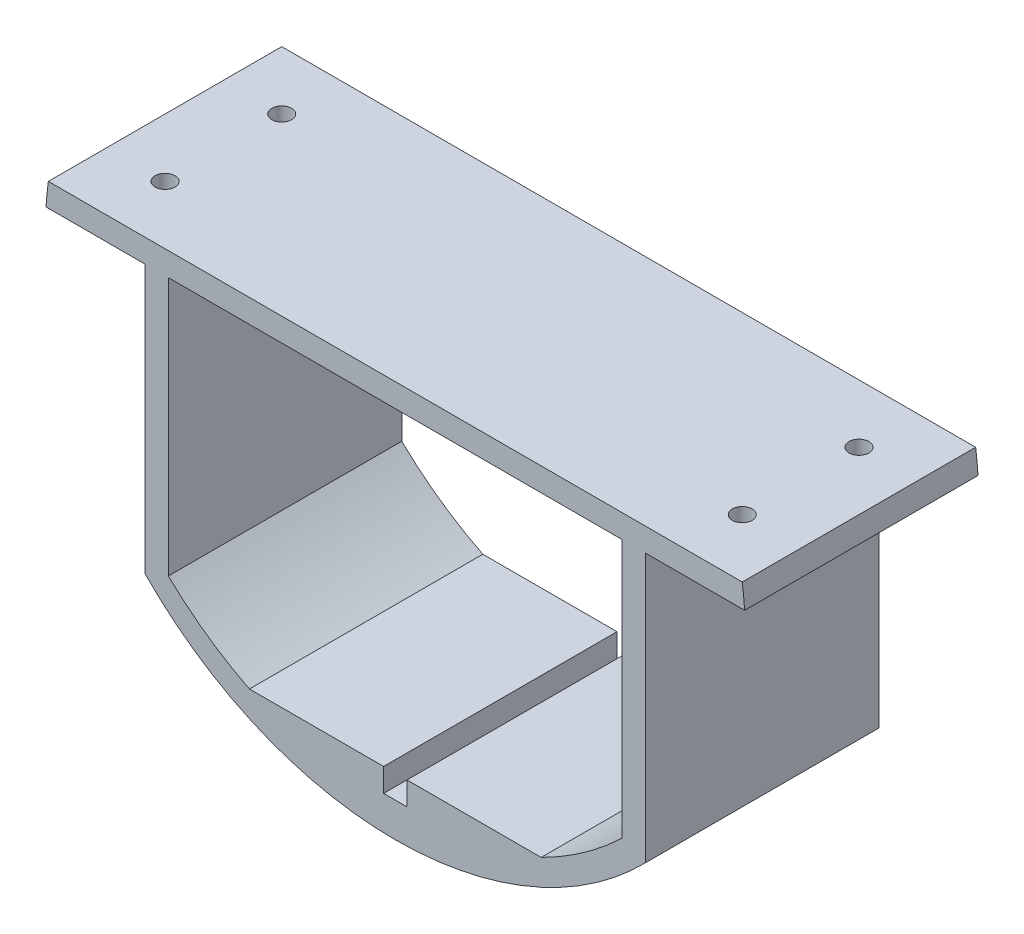
ISO-10303-21;
HEADER;
FILE_DESCRIPTION(('STEP AP214'),'2;1');
FILE_NAME('part.step','',(''),(''),'','','');
FILE_SCHEMA(('AUTOMOTIVE_DESIGN { 1 0 10303 214 1 1 1 1 }'));
ENDSEC;
DATA;
#1=APPLICATION_CONTEXT('core data for automotive mechanical design processes');
#2=APPLICATION_PROTOCOL_DEFINITION('international standard','automotive_design',2000,#1);
#3=PRODUCT_CONTEXT('',#1,'mechanical');
#4=PRODUCT('Part','Part','',(#3));
#5=PRODUCT_RELATED_PRODUCT_CATEGORY('part','',(#4));
#6=PRODUCT_DEFINITION_FORMATION('','',#4);
#7=PRODUCT_DEFINITION_CONTEXT('part definition',#1,'design');
#8=PRODUCT_DEFINITION('design','',#6,#7);
#9=PRODUCT_DEFINITION_SHAPE('','',#8);
#10=(LENGTH_UNIT() NAMED_UNIT(*) SI_UNIT(.MILLI.,.METRE.));
#11=(NAMED_UNIT(*) PLANE_ANGLE_UNIT() SI_UNIT($,.RADIAN.));
#12=(NAMED_UNIT(*) SI_UNIT($,.STERADIAN.) SOLID_ANGLE_UNIT());
#13=UNCERTAINTY_MEASURE_WITH_UNIT(LENGTH_MEASURE(1.E-05),#10,'distance_accuracy_value','');
#14=(GEOMETRIC_REPRESENTATION_CONTEXT(3) GLOBAL_UNCERTAINTY_ASSIGNED_CONTEXT((#13)) GLOBAL_UNIT_ASSIGNED_CONTEXT((#10,
#11,#12)) REPRESENTATION_CONTEXT('',''));
#15=CARTESIAN_POINT('',(0.,0.,0.));
#16=DIRECTION('',(0.,0.,1.));
#17=DIRECTION('',(1.,0.,0.));
#18=AXIS2_PLACEMENT_3D('',#15,#16,#17);
#19=CARTESIAN_POINT('',(0.,0.,50.8));
#20=DIRECTION('',(0.,0.,-1.));
#21=DIRECTION('',(-1.,0.,0.));
#22=AXIS2_PLACEMENT_3D('',#19,#20,#21);
#23=CYLINDRICAL_SURFACE('',#22,76.2);
#24=CARTESIAN_POINT('',(0.,0.,0.));
#25=DIRECTION('',(0.,0.,1.));
#26=DIRECTION('',(1.,0.,0.));
#27=AXIS2_PLACEMENT_3D('',#24,#25,#26);
#28=CIRCLE('',#27,76.2);
#29=CARTESIAN_POINT('',(-75.519629236378,10.16,0.));
#30=VERTEX_POINT('',#29);
#31=CARTESIAN_POINT('',(-76.0304780992465,5.08,0.));
#32=VERTEX_POINT('',#31);
#33=EDGE_CURVE('E179',#30,#32,#28,.T.);
#34=ORIENTED_EDGE('',*,*,#33,.T.);
#35=DIRECTION('',(0.,0.,1.));
#36=VECTOR('',#35,1.);
#37=CARTESIAN_POINT('',(-76.0304780992465,5.08,0.));
#38=LINE('',#37,#36);
#39=CARTESIAN_POINT('',(-76.0304780992465,5.08,50.8));
#40=VERTEX_POINT('',#39);
#41=EDGE_CURVE('E163',#32,#40,#38,.T.);
#42=ORIENTED_EDGE('',*,*,#41,.T.);
#43=CARTESIAN_POINT('',(0.,0.,50.8));
#44=DIRECTION('',(0.,0.,1.));
#45=DIRECTION('',(1.,0.,0.));
#46=AXIS2_PLACEMENT_3D('',#43,#44,#45);
#47=CIRCLE('',#46,76.2);
#48=CARTESIAN_POINT('',(-75.519629236378,10.16,50.8));
#49=VERTEX_POINT('',#48);
#50=EDGE_CURVE('E191',#49,#40,#47,.T.);
#51=ORIENTED_EDGE('',*,*,#50,.F.);
#52=DIRECTION('',(0.,0.,1.));
#53=VECTOR('',#52,1.);
#54=CARTESIAN_POINT('',(-75.519629236378,10.16,-25.4));
#55=LINE('',#54,#53);
#56=EDGE_CURVE('E184',#30,#49,#55,.T.);
#57=ORIENTED_EDGE('',*,*,#56,.F.);
#58=EDGE_LOOP('',(#34,#42,#51,#57));
#59=FACE_BOUND('',#58,.T.);
#60=ADVANCED_FACE('F38',(#59),#23,.T.);
#61=CARTESIAN_POINT('',(-54.4769308973991,-53.2794894870438,50.8));
#62=VERTEX_POINT('',#61);
#63=CARTESIAN_POINT('',(54.4769308973991,-53.2794894870438,50.8));
#64=VERTEX_POINT('',#63);
#65=EDGE_CURVE('E189',#62,#64,#47,.T.);
#66=ORIENTED_EDGE('',*,*,#65,.F.);
#67=DIRECTION('',(0.,0.,1.));
#68=VECTOR('',#67,1.);
#69=CARTESIAN_POINT('',(-54.4769308973991,-53.2794894870438,0.));
#70=LINE('',#69,#68);
#71=CARTESIAN_POINT('',(-54.4769308973991,-53.2794894870438,0.));
#72=VERTEX_POINT('',#71);
#73=EDGE_CURVE('E171',#72,#62,#70,.T.);
#74=ORIENTED_EDGE('',*,*,#73,.F.);
#75=CARTESIAN_POINT('',(54.4769308973991,-53.2794894870438,0.));
#76=VERTEX_POINT('',#75);
#77=EDGE_CURVE('E186',#72,#76,#28,.T.);
#78=ORIENTED_EDGE('',*,*,#77,.T.);
#79=DIRECTION('',(0.,0.,1.));
#80=VECTOR('',#79,1.);
#81=CARTESIAN_POINT('',(54.4769308973991,-53.2794894870438,0.));
#82=LINE('',#81,#80);
#83=EDGE_CURVE('E223',#76,#64,#82,.T.);
#84=ORIENTED_EDGE('',*,*,#83,.T.);
#85=EDGE_LOOP('',(#66,#74,#78,#84));
#86=FACE_BOUND('',#85,.T.);
#87=ADVANCED_FACE('F222',(#86),#23,.T.);
#88=CARTESIAN_POINT('',(0.,-63.6395466671472,-25.4));
#89=DIRECTION('',(0.,-1.,0.));
#90=DIRECTION('',(0.,0.,-1.));
#91=AXIS2_PLACEMENT_3D('',#88,#89,#90);
#92=PLANE('',#91);
#93=DIRECTION('',(1.,0.,0.));
#94=VECTOR('',#93,1.);
#95=CARTESIAN_POINT('',(0.,-63.6395466671472,50.8));
#96=LINE('',#95,#94);
#97=CARTESIAN_POINT('',(-31.75,-63.6395466671472,50.8));
#98=VERTEX_POINT('',#97);
#99=CARTESIAN_POINT('',(-2.54,-63.6395466671472,50.8));
#100=VERTEX_POINT('',#99);
#101=EDGE_CURVE('E274',#98,#100,#96,.T.);
#102=ORIENTED_EDGE('',*,*,#101,.T.);
#103=DIRECTION('',(0.,0.,1.));
#104=VECTOR('',#103,1.);
#105=CARTESIAN_POINT('',(-2.54,-63.6395466671472,0.));
#106=LINE('',#105,#104);
#107=CARTESIAN_POINT('',(-2.54,-63.6395466671472,0.));
#108=VERTEX_POINT('',#107);
#109=EDGE_CURVE('E259',#108,#100,#106,.T.);
#110=ORIENTED_EDGE('',*,*,#109,.F.);
#111=DIRECTION('',(1.,0.,0.));
#112=VECTOR('',#111,1.);
#113=CARTESIAN_POINT('',(0.,-63.6395466671472,0.));
#114=LINE('',#113,#112);
#115=CARTESIAN_POINT('',(-31.75,-63.6395466671472,0.));
#116=VERTEX_POINT('',#115);
#117=EDGE_CURVE('E310',#116,#108,#114,.T.);
#118=ORIENTED_EDGE('',*,*,#117,.F.);
#119=DIRECTION('',(0.,0.,1.));
#120=VECTOR('',#119,1.);
#121=CARTESIAN_POINT('',(-31.75,-63.6395466671472,-25.4));
#122=LINE('',#121,#120);
#123=EDGE_CURVE('E293',#116,#98,#122,.T.);
#124=ORIENTED_EDGE('',*,*,#123,.T.);
#125=EDGE_LOOP('',(#102,#110,#118,#124));
#126=FACE_BOUND('',#125,.T.);
#127=ADVANCED_FACE('F307',(#126),#92,.F.);
#128=CARTESIAN_POINT('',(76.0304780992465,5.08000000000001,50.8));
#129=VERTEX_POINT('',#128);
#130=CARTESIAN_POINT('',(75.519629236378,10.16,50.8));
#131=VERTEX_POINT('',#130);
#132=EDGE_CURVE('E185',#129,#131,#47,.T.);
#133=ORIENTED_EDGE('',*,*,#132,.F.);
#134=DIRECTION('',(0.,0.,1.));
#135=VECTOR('',#134,1.);
#136=CARTESIAN_POINT('',(76.0304780992465,5.08000000000001,0.));
#137=LINE('',#136,#135);
#138=CARTESIAN_POINT('',(76.0304780992465,5.08000000000001,0.));
#139=VERTEX_POINT('',#138);
#140=EDGE_CURVE('E226',#139,#129,#137,.T.);
#141=ORIENTED_EDGE('',*,*,#140,.F.);
#142=CARTESIAN_POINT('',(75.519629236378,10.16,0.));
#143=VERTEX_POINT('',#142);
#144=EDGE_CURVE('E188',#139,#143,#28,.T.);
#145=ORIENTED_EDGE('',*,*,#144,.T.);
#146=DIRECTION('',(0.,0.,1.));
#147=VECTOR('',#146,1.);
#148=CARTESIAN_POINT('',(75.519629236378,10.16,-25.4));
#149=LINE('',#148,#147);
#150=EDGE_CURVE('E194',#143,#131,#149,.T.);
#151=ORIENTED_EDGE('',*,*,#150,.T.);
#152=EDGE_LOOP('',(#133,#141,#145,#151));
#153=FACE_BOUND('',#152,.T.);
#154=ADVANCED_FACE('F40',(#153),#23,.T.);
#155=CARTESIAN_POINT('',(0.,0.,50.8));
#156=DIRECTION('',(0.,0.,1.));
#157=DIRECTION('',(1.,0.,0.));
#158=AXIS2_PLACEMENT_3D('',#155,#156,#157);
#159=PLANE('',#158);
#160=DIRECTION('',(-1.,0.,0.));
#161=VECTOR('',#160,1.);
#162=CARTESIAN_POINT('',(-54.4769308973991,5.08000000000001,50.8));
#163=LINE('',#162,#161);
#164=CARTESIAN_POINT('',(-54.4769308973991,5.08000000000001,50.8));
#165=VERTEX_POINT('',#164);
#166=EDGE_CURVE('E166',#165,#40,#163,.T.);
#167=ORIENTED_EDGE('',*,*,#166,.F.);
#168=DIRECTION('',(0.,1.,0.));
#169=VECTOR('',#168,1.);
#170=CARTESIAN_POINT('',(-54.4769308973991,5.08000000000001,50.8));
#171=LINE('',#170,#169);
#172=EDGE_CURVE('E181',#62,#165,#171,.T.);
#173=ORIENTED_EDGE('',*,*,#172,.F.);
#174=ORIENTED_EDGE('',*,*,#65,.T.);
#175=DIRECTION('',(0.,-1.,0.));
#176=VECTOR('',#175,1.);
#177=CARTESIAN_POINT('',(54.4769308973991,5.08000000000001,50.8));
#178=LINE('',#177,#176);
#179=CARTESIAN_POINT('',(54.4769308973991,5.08000000000001,50.8));
#180=VERTEX_POINT('',#179);
#181=EDGE_CURVE('E217',#180,#64,#178,.T.);
#182=ORIENTED_EDGE('',*,*,#181,.F.);
#183=DIRECTION('',(-1.,0.,0.));
#184=VECTOR('',#183,1.);
#185=CARTESIAN_POINT('',(54.4769308973991,5.08000000000001,50.8));
#186=LINE('',#185,#184);
#187=EDGE_CURVE('E233',#129,#180,#186,.T.);
#188=ORIENTED_EDGE('',*,*,#187,.F.);
#189=ORIENTED_EDGE('',*,*,#132,.T.);
#190=DIRECTION('',(1.,0.,0.));
#191=VECTOR('',#190,1.);
#192=CARTESIAN_POINT('',(-75.519629236378,10.16,50.8));
#193=LINE('',#192,#191);
#194=EDGE_CURVE('E202',#49,#131,#193,.T.);
#195=ORIENTED_EDGE('',*,*,#194,.F.);
#196=ORIENTED_EDGE('',*,*,#50,.T.);
#197=EDGE_LOOP('',(#167,#173,#174,#182,#188,#189,#195,#196));
#198=FACE_BOUND('',#197,.T.);
#199=DIRECTION('',(0.,-1.,0.));
#200=VECTOR('',#199,1.);
#201=CARTESIAN_POINT('',(-2.54,-63.6395466671472,50.8));
#202=LINE('',#201,#200);
#203=CARTESIAN_POINT('',(-2.54,-68.7195466671472,50.8));
#204=VERTEX_POINT('',#203);
#205=EDGE_CURVE('E251',#100,#204,#202,.T.);
#206=ORIENTED_EDGE('',*,*,#205,.F.);
#207=ORIENTED_EDGE('',*,*,#101,.F.);
#208=CARTESIAN_POINT('',(0.,0.,50.8));
#209=DIRECTION('',(0.,0.,1.));
#210=DIRECTION('',(1.,0.,0.));
#211=AXIS2_PLACEMENT_3D('',#208,#209,#210);
#212=CIRCLE('',#211,71.12);
#213=CARTESIAN_POINT('',(-49.3969308973991,-51.1663719440569,50.8));
#214=VERTEX_POINT('',#213);
#215=EDGE_CURVE('E269',#214,#98,#212,.T.);
#216=ORIENTED_EDGE('',*,*,#215,.F.);
#217=DIRECTION('',(0.,-1.,0.));
#218=VECTOR('',#217,1.);
#219=CARTESIAN_POINT('',(-49.3969308973991,0.,50.8));
#220=LINE('',#219,#218);
#221=CARTESIAN_POINT('',(-49.3969308973991,5.08000000000001,50.8));
#222=VERTEX_POINT('',#221);
#223=EDGE_CURVE('E261',#222,#214,#220,.T.);
#224=ORIENTED_EDGE('',*,*,#223,.F.);
#225=DIRECTION('',(1.,0.,0.));
#226=VECTOR('',#225,1.);
#227=CARTESIAN_POINT('',(0.,5.08000000000001,50.8));
#228=LINE('',#227,#226);
#229=CARTESIAN_POINT('',(49.3969308973991,5.08000000000001,50.8));
#230=VERTEX_POINT('',#229);
#231=EDGE_CURVE('E280',#222,#230,#228,.T.);
#232=ORIENTED_EDGE('',*,*,#231,.T.);
#233=DIRECTION('',(0.,-1.,0.));
#234=VECTOR('',#233,1.);
#235=CARTESIAN_POINT('',(49.3969308973991,0.,50.8));
#236=LINE('',#235,#234);
#237=CARTESIAN_POINT('',(49.3969308973991,-51.1663719440569,50.8));
#238=VERTEX_POINT('',#237);
#239=EDGE_CURVE('E277',#230,#238,#236,.T.);
#240=ORIENTED_EDGE('',*,*,#239,.T.);
#241=CARTESIAN_POINT('',(31.75,-63.6395466671472,50.8));
#242=VERTEX_POINT('',#241);
#243=EDGE_CURVE('E273',#242,#238,#212,.T.);
#244=ORIENTED_EDGE('',*,*,#243,.F.);
#245=CARTESIAN_POINT('',(2.54,-63.6395466671472,50.8));
#246=VERTEX_POINT('',#245);
#247=EDGE_CURVE('E272',#246,#242,#96,.T.);
#248=ORIENTED_EDGE('',*,*,#247,.F.);
#249=DIRECTION('',(0.,1.,0.));
#250=VECTOR('',#249,1.);
#251=CARTESIAN_POINT('',(2.54,-63.6395466671472,50.8));
#252=LINE('',#251,#250);
#253=CARTESIAN_POINT('',(2.54,-68.7195466671472,50.8));
#254=VERTEX_POINT('',#253);
#255=EDGE_CURVE('E244',#254,#246,#252,.T.);
#256=ORIENTED_EDGE('',*,*,#255,.F.);
#257=DIRECTION('',(1.,0.,0.));
#258=VECTOR('',#257,1.);
#259=CARTESIAN_POINT('',(-2.54,-68.7195466671472,50.8));
#260=LINE('',#259,#258);
#261=EDGE_CURVE('E254',#204,#254,#260,.T.);
#262=ORIENTED_EDGE('',*,*,#261,.F.);
#263=EDGE_LOOP('',(#206,#207,#216,#224,#232,#240,#244,#248,#256,#262));
#264=FACE_BOUND('',#263,.T.);
#265=ADVANCED_FACE('F214',(#198,#264),#159,.T.);
#266=CARTESIAN_POINT('',(0.,0.,0.));
#267=DIRECTION('',(0.,0.,1.));
#268=DIRECTION('',(1.,0.,0.));
#269=AXIS2_PLACEMENT_3D('',#266,#267,#268);
#270=PLANE('',#269);
#271=ORIENTED_EDGE('',*,*,#117,.T.);
#272=DIRECTION('',(0.,-1.,0.));
#273=VECTOR('',#272,1.);
#274=CARTESIAN_POINT('',(-2.54,-63.6395466671472,0.));
#275=LINE('',#274,#273);
#276=CARTESIAN_POINT('',(-2.54,-68.7195466671472,0.));
#277=VERTEX_POINT('',#276);
#278=EDGE_CURVE('E240',#108,#277,#275,.T.);
#279=ORIENTED_EDGE('',*,*,#278,.T.);
#280=DIRECTION('',(1.,0.,0.));
#281=VECTOR('',#280,1.);
#282=CARTESIAN_POINT('',(-2.54,-68.7195466671472,0.));
#283=LINE('',#282,#281);
#284=CARTESIAN_POINT('',(2.54,-68.7195466671472,0.));
#285=VERTEX_POINT('',#284);
#286=EDGE_CURVE('E243',#277,#285,#283,.T.);
#287=ORIENTED_EDGE('',*,*,#286,.T.);
#288=DIRECTION('',(0.,1.,0.));
#289=VECTOR('',#288,1.);
#290=CARTESIAN_POINT('',(2.54,-63.6395466671472,0.));
#291=LINE('',#290,#289);
#292=CARTESIAN_POINT('',(2.54,-63.6395466671472,0.));
#293=VERTEX_POINT('',#292);
#294=EDGE_CURVE('E247',#285,#293,#291,.T.);
#295=ORIENTED_EDGE('',*,*,#294,.T.);
#296=CARTESIAN_POINT('',(31.75,-63.6395466671472,0.));
#297=VERTEX_POINT('',#296);
#298=EDGE_CURVE('E313',#293,#297,#114,.T.);
#299=ORIENTED_EDGE('',*,*,#298,.T.);
#300=CARTESIAN_POINT('',(0.,0.,0.));
#301=DIRECTION('',(0.,0.,1.));
#302=DIRECTION('',(1.,0.,0.));
#303=AXIS2_PLACEMENT_3D('',#300,#301,#302);
#304=CIRCLE('',#303,71.12);
#305=CARTESIAN_POINT('',(49.3969308973991,-51.1663719440569,0.));
#306=VERTEX_POINT('',#305);
#307=EDGE_CURVE('E312',#297,#306,#304,.T.);
#308=ORIENTED_EDGE('',*,*,#307,.T.);
#309=DIRECTION('',(0.,-1.,0.));
#310=VECTOR('',#309,1.);
#311=CARTESIAN_POINT('',(49.3969308973991,0.,0.));
#312=LINE('',#311,#310);
#313=CARTESIAN_POINT('',(49.3969308973991,5.08000000000001,0.));
#314=VERTEX_POINT('',#313);
#315=EDGE_CURVE('E320',#314,#306,#312,.T.);
#316=ORIENTED_EDGE('',*,*,#315,.F.);
#317=DIRECTION('',(1.,0.,0.));
#318=VECTOR('',#317,1.);
#319=CARTESIAN_POINT('',(0.,5.08000000000001,0.));
#320=LINE('',#319,#318);
#321=CARTESIAN_POINT('',(-49.3969308973991,5.08000000000001,0.));
#322=VERTEX_POINT('',#321);
#323=EDGE_CURVE('E47',#322,#314,#320,.T.);
#324=ORIENTED_EDGE('',*,*,#323,.F.);
#325=DIRECTION('',(0.,-1.,0.));
#326=VECTOR('',#325,1.);
#327=CARTESIAN_POINT('',(-49.3969308973991,0.,0.));
#328=LINE('',#327,#326);
#329=CARTESIAN_POINT('',(-49.3969308973991,-51.1663719440569,0.));
#330=VERTEX_POINT('',#329);
#331=EDGE_CURVE('E11',#322,#330,#328,.T.);
#332=ORIENTED_EDGE('',*,*,#331,.T.);
#333=CARTESIAN_POINT('',(0.,0.,0.));
#334=DIRECTION('',(0.,0.,1.));
#335=DIRECTION('',(1.,0.,0.));
#336=AXIS2_PLACEMENT_3D('',#333,#334,#335);
#337=CIRCLE('',#336,71.12);
#338=EDGE_CURVE('E209',#330,#116,#337,.T.);
#339=ORIENTED_EDGE('',*,*,#338,.T.);
#340=EDGE_LOOP('',(#271,#279,#287,#295,#299,#308,#316,#324,#332,#339));
#341=FACE_BOUND('',#340,.T.);
#342=DIRECTION('',(0.,1.,0.));
#343=VECTOR('',#342,1.);
#344=CARTESIAN_POINT('',(-54.4769308973991,5.08000000000001,0.));
#345=LINE('',#344,#343);
#346=CARTESIAN_POINT('',(-54.4769308973991,5.08000000000001,0.));
#347=VERTEX_POINT('',#346);
#348=EDGE_CURVE('E172',#72,#347,#345,.T.);
#349=ORIENTED_EDGE('',*,*,#348,.T.);
#350=DIRECTION('',(-1.,0.,0.));
#351=VECTOR('',#350,1.);
#352=CARTESIAN_POINT('',(-54.4769308973991,5.08000000000001,0.));
#353=LINE('',#352,#351);
#354=EDGE_CURVE('E55',#347,#32,#353,.T.);
#355=ORIENTED_EDGE('',*,*,#354,.T.);
#356=ORIENTED_EDGE('',*,*,#33,.F.);
#357=DIRECTION('',(1.,0.,0.));
#358=VECTOR('',#357,1.);
#359=CARTESIAN_POINT('',(0.,10.16,0.));
#360=LINE('',#359,#358);
#361=EDGE_CURVE('E206',#30,#143,#360,.T.);
#362=ORIENTED_EDGE('',*,*,#361,.T.);
#363=ORIENTED_EDGE('',*,*,#144,.F.);
#364=DIRECTION('',(-1.,0.,0.));
#365=VECTOR('',#364,1.);
#366=CARTESIAN_POINT('',(54.4769308973991,5.08000000000001,0.));
#367=LINE('',#366,#365);
#368=CARTESIAN_POINT('',(54.4769308973991,5.08000000000001,0.));
#369=VERTEX_POINT('',#368);
#370=EDGE_CURVE('E234',#139,#369,#367,.T.);
#371=ORIENTED_EDGE('',*,*,#370,.T.);
#372=DIRECTION('',(0.,-1.,0.));
#373=VECTOR('',#372,1.);
#374=CARTESIAN_POINT('',(54.4769308973991,5.08000000000001,0.));
#375=LINE('',#374,#373);
#376=EDGE_CURVE('E63',#369,#76,#375,.T.);
#377=ORIENTED_EDGE('',*,*,#376,.T.);
#378=ORIENTED_EDGE('',*,*,#77,.F.);
#379=EDGE_LOOP('',(#349,#355,#356,#362,#363,#371,#377,#378));
#380=FACE_BOUND('',#379,.T.);
#381=ADVANCED_FACE('F177',(#341,#380),#270,.F.);
#382=CARTESIAN_POINT('',(-75.519629236378,10.16,-25.4));
#383=DIRECTION('',(0.,-1.,0.));
#384=DIRECTION('',(0.,0.,-1.));
#385=AXIS2_PLACEMENT_3D('',#382,#383,#384);
#386=PLANE('',#385);
#387=CARTESIAN_POINT('',(-62.819629236378,10.16,38.1));
#388=DIRECTION('',(0.,1.,0.));
#389=DIRECTION('',(0.,0.,1.));
#390=AXIS2_PLACEMENT_3D('',#387,#388,#389);
#391=CIRCLE('',#390,2.159);
#392=CARTESIAN_POINT('',(-62.819629236378,10.16,40.259));
#393=VERTEX_POINT('',#392);
#394=EDGE_CURVE('E608',#393,#393,#391,.T.);
#395=ORIENTED_EDGE('',*,*,#394,.F.);
#396=EDGE_LOOP('',(#395));
#397=FACE_BOUND('',#396,.T.);
#398=CARTESIAN_POINT('',(62.819629236378,10.16,12.7));
#399=DIRECTION('',(0.,1.,0.));
#400=DIRECTION('',(0.,0.,1.));
#401=AXIS2_PLACEMENT_3D('',#398,#399,#400);
#402=CIRCLE('',#401,2.15900000000001);
#403=CARTESIAN_POINT('',(62.819629236378,10.16,14.859));
#404=VERTEX_POINT('',#403);
#405=EDGE_CURVE('E611',#404,#404,#402,.T.);
#406=ORIENTED_EDGE('',*,*,#405,.F.);
#407=EDGE_LOOP('',(#406));
#408=FACE_BOUND('',#407,.T.);
#409=CARTESIAN_POINT('',(62.819629236378,10.16,38.1));
#410=DIRECTION('',(0.,1.,0.));
#411=DIRECTION('',(0.,0.,1.));
#412=AXIS2_PLACEMENT_3D('',#409,#410,#411);
#413=CIRCLE('',#412,2.15900000000001);
#414=CARTESIAN_POINT('',(62.819629236378,10.16,40.259));
#415=VERTEX_POINT('',#414);
#416=EDGE_CURVE('E620',#415,#415,#413,.T.);
#417=ORIENTED_EDGE('',*,*,#416,.F.);
#418=EDGE_LOOP('',(#417));
#419=FACE_BOUND('',#418,.T.);
#420=CARTESIAN_POINT('',(-62.819629236378,10.16,12.7));
#421=DIRECTION('',(0.,1.,0.));
#422=DIRECTION('',(0.,0.,1.));
#423=AXIS2_PLACEMENT_3D('',#420,#421,#422);
#424=CIRCLE('',#423,2.159);
#425=CARTESIAN_POINT('',(-62.819629236378,10.16,14.859));
#426=VERTEX_POINT('',#425);
#427=EDGE_CURVE('E327',#426,#426,#424,.T.);
#428=ORIENTED_EDGE('',*,*,#427,.F.);
#429=EDGE_LOOP('',(#428));
#430=FACE_BOUND('',#429,.T.);
#431=ORIENTED_EDGE('',*,*,#56,.T.);
#432=ORIENTED_EDGE('',*,*,#194,.T.);
#433=ORIENTED_EDGE('',*,*,#150,.F.);
#434=ORIENTED_EDGE('',*,*,#361,.F.);
#435=EDGE_LOOP('',(#431,#432,#433,#434));
#436=FACE_BOUND('',#435,.T.);
#437=ADVANCED_FACE('F365',(#397,#408,#419,#430,#436),#386,.F.);
#438=CARTESIAN_POINT('',(-49.3969308973991,0.,-25.4));
#439=DIRECTION('',(-1.,0.,0.));
#440=DIRECTION('',(0.,-1.,0.));
#441=AXIS2_PLACEMENT_3D('',#438,#439,#440);
#442=PLANE('',#441);
#443=DIRECTION('',(0.,0.,1.));
#444=VECTOR('',#443,1.);
#445=CARTESIAN_POINT('',(-49.3969308973991,5.08000000000001,-25.4));
#446=LINE('',#445,#444);
#447=EDGE_CURVE('E284',#322,#222,#446,.T.);
#448=ORIENTED_EDGE('',*,*,#447,.T.);
#449=ORIENTED_EDGE('',*,*,#223,.T.);
#450=DIRECTION('',(0.,0.,1.));
#451=VECTOR('',#450,1.);
#452=CARTESIAN_POINT('',(-49.3969308973991,-51.1663719440569,-25.4));
#453=LINE('',#452,#451);
#454=EDGE_CURVE('E283',#330,#214,#453,.T.);
#455=ORIENTED_EDGE('',*,*,#454,.F.);
#456=ORIENTED_EDGE('',*,*,#331,.F.);
#457=EDGE_LOOP('',(#448,#449,#455,#456));
#458=FACE_BOUND('',#457,.T.);
#459=ADVANCED_FACE('F392',(#458),#442,.F.);
#460=CARTESIAN_POINT('',(0.,5.08000000000001,-25.4));
#461=DIRECTION('',(0.,-1.,0.));
#462=DIRECTION('',(0.,0.,-1.));
#463=AXIS2_PLACEMENT_3D('',#460,#461,#462);
#464=PLANE('',#463);
#465=ORIENTED_EDGE('',*,*,#323,.T.);
#466=DIRECTION('',(0.,0.,1.));
#467=VECTOR('',#466,1.);
#468=CARTESIAN_POINT('',(49.3969308973991,5.08000000000001,-25.4));
#469=LINE('',#468,#467);
#470=EDGE_CURVE('E286',#314,#230,#469,.T.);
#471=ORIENTED_EDGE('',*,*,#470,.T.);
#472=ORIENTED_EDGE('',*,*,#231,.F.);
#473=ORIENTED_EDGE('',*,*,#447,.F.);
#474=EDGE_LOOP('',(#465,#471,#472,#473));
#475=FACE_BOUND('',#474,.T.);
#476=ADVANCED_FACE('F388',(#475),#464,.T.);
#477=CARTESIAN_POINT('',(49.3969308973991,0.,-25.4));
#478=DIRECTION('',(-1.,0.,0.));
#479=DIRECTION('',(0.,-1.,0.));
#480=AXIS2_PLACEMENT_3D('',#477,#478,#479);
#481=PLANE('',#480);
#482=ORIENTED_EDGE('',*,*,#315,.T.);
#483=DIRECTION('',(0.,0.,1.));
#484=VECTOR('',#483,1.);
#485=CARTESIAN_POINT('',(49.3969308973991,-51.1663719440569,-25.4));
#486=LINE('',#485,#484);
#487=EDGE_CURVE('E288',#306,#238,#486,.T.);
#488=ORIENTED_EDGE('',*,*,#487,.T.);
#489=ORIENTED_EDGE('',*,*,#239,.F.);
#490=ORIENTED_EDGE('',*,*,#470,.F.);
#491=EDGE_LOOP('',(#482,#488,#489,#490));
#492=FACE_BOUND('',#491,.T.);
#493=ADVANCED_FACE('F391',(#492),#481,.T.);
#494=CARTESIAN_POINT('',(0.,0.,-25.4));
#495=DIRECTION('',(0.,0.,1.));
#496=DIRECTION('',(1.,0.,0.));
#497=AXIS2_PLACEMENT_3D('',#494,#495,#496);
#498=CYLINDRICAL_SURFACE('',#497,71.12);
#499=DIRECTION('',(0.,0.,1.));
#500=VECTOR('',#499,1.);
#501=CARTESIAN_POINT('',(31.75,-63.6395466671472,-25.4));
#502=LINE('',#501,#500);
#503=EDGE_CURVE('E290',#297,#242,#502,.T.);
#504=ORIENTED_EDGE('',*,*,#503,.T.);
#505=ORIENTED_EDGE('',*,*,#243,.T.);
#506=ORIENTED_EDGE('',*,*,#487,.F.);
#507=ORIENTED_EDGE('',*,*,#307,.F.);
#508=EDGE_LOOP('',(#504,#505,#506,#507));
#509=FACE_BOUND('',#508,.T.);
#510=ADVANCED_FACE('F396',(#509),#498,.F.);
#511=ORIENTED_EDGE('',*,*,#298,.F.);
#512=DIRECTION('',(0.,0.,1.));
#513=VECTOR('',#512,1.);
#514=CARTESIAN_POINT('',(2.54,-63.6395466671472,0.));
#515=LINE('',#514,#513);
#516=EDGE_CURVE('E262',#293,#246,#515,.T.);
#517=ORIENTED_EDGE('',*,*,#516,.T.);
#518=ORIENTED_EDGE('',*,*,#247,.T.);
#519=ORIENTED_EDGE('',*,*,#503,.F.);
#520=EDGE_LOOP('',(#511,#517,#518,#519));
#521=FACE_BOUND('',#520,.T.);
#522=ADVANCED_FACE('F362',(#521),#92,.F.);
#523=ORIENTED_EDGE('',*,*,#454,.T.);
#524=ORIENTED_EDGE('',*,*,#215,.T.);
#525=ORIENTED_EDGE('',*,*,#123,.F.);
#526=ORIENTED_EDGE('',*,*,#338,.F.);
#527=EDGE_LOOP('',(#523,#524,#525,#526));
#528=FACE_BOUND('',#527,.T.);
#529=ADVANCED_FACE('F298',(#528),#498,.F.);
#530=CARTESIAN_POINT('',(-2.54,-63.6395466671472,0.));
#531=DIRECTION('',(-1.,0.,0.));
#532=DIRECTION('',(0.,-1.,0.));
#533=AXIS2_PLACEMENT_3D('',#530,#531,#532);
#534=PLANE('',#533);
#535=ORIENTED_EDGE('',*,*,#205,.T.);
#536=DIRECTION('',(0.,0.,1.));
#537=VECTOR('',#536,1.);
#538=CARTESIAN_POINT('',(-2.54,-68.7195466671472,0.));
#539=LINE('',#538,#537);
#540=EDGE_CURVE('E250',#277,#204,#539,.T.);
#541=ORIENTED_EDGE('',*,*,#540,.F.);
#542=ORIENTED_EDGE('',*,*,#278,.F.);
#543=ORIENTED_EDGE('',*,*,#109,.T.);
#544=EDGE_LOOP('',(#535,#541,#542,#543));
#545=FACE_BOUND('',#544,.T.);
#546=ADVANCED_FACE('F382',(#545),#534,.F.);
#547=CARTESIAN_POINT('',(2.54,-63.6395466671472,0.));
#548=DIRECTION('',(1.,0.,0.));
#549=DIRECTION('',(0.,1.,0.));
#550=AXIS2_PLACEMENT_3D('',#547,#548,#549);
#551=PLANE('',#550);
#552=ORIENTED_EDGE('',*,*,#255,.T.);
#553=ORIENTED_EDGE('',*,*,#516,.F.);
#554=ORIENTED_EDGE('',*,*,#294,.F.);
#555=DIRECTION('',(0.,0.,1.));
#556=VECTOR('',#555,1.);
#557=CARTESIAN_POINT('',(2.54,-68.7195466671472,0.));
#558=LINE('',#557,#556);
#559=EDGE_CURVE('E265',#285,#254,#558,.T.);
#560=ORIENTED_EDGE('',*,*,#559,.T.);
#561=EDGE_LOOP('',(#552,#553,#554,#560));
#562=FACE_BOUND('',#561,.T.);
#563=ADVANCED_FACE('F376',(#562),#551,.F.);
#564=CARTESIAN_POINT('',(-2.54,-68.7195466671472,0.));
#565=DIRECTION('',(0.,-1.,0.));
#566=DIRECTION('',(0.,0.,-1.));
#567=AXIS2_PLACEMENT_3D('',#564,#565,#566);
#568=PLANE('',#567);
#569=ORIENTED_EDGE('',*,*,#261,.T.);
#570=ORIENTED_EDGE('',*,*,#559,.F.);
#571=ORIENTED_EDGE('',*,*,#286,.F.);
#572=ORIENTED_EDGE('',*,*,#540,.T.);
#573=EDGE_LOOP('',(#569,#570,#571,#572));
#574=FACE_BOUND('',#573,.T.);
#575=ADVANCED_FACE('F368',(#574),#568,.F.);
#576=CARTESIAN_POINT('',(54.4769308973991,5.08000000000001,0.));
#577=DIRECTION('',(-1.,0.,0.));
#578=DIRECTION('',(0.,0.,1.));
#579=AXIS2_PLACEMENT_3D('',#576,#577,#578);
#580=PLANE('',#579);
#581=ORIENTED_EDGE('',*,*,#181,.T.);
#582=ORIENTED_EDGE('',*,*,#83,.F.);
#583=ORIENTED_EDGE('',*,*,#376,.F.);
#584=DIRECTION('',(0.,0.,1.));
#585=VECTOR('',#584,1.);
#586=CARTESIAN_POINT('',(54.4769308973991,5.08000000000001,0.));
#587=LINE('',#586,#585);
#588=EDGE_CURVE('E224',#369,#180,#587,.T.);
#589=ORIENTED_EDGE('',*,*,#588,.T.);
#590=EDGE_LOOP('',(#581,#582,#583,#589));
#591=FACE_BOUND('',#590,.T.);
#592=ADVANCED_FACE('F366',(#591),#580,.F.);
#593=CARTESIAN_POINT('',(54.4769308973991,5.08000000000001,0.));
#594=DIRECTION('',(0.,1.,0.));
#595=DIRECTION('',(0.,0.,1.));
#596=AXIS2_PLACEMENT_3D('',#593,#594,#595);
#597=PLANE('',#596);
#598=CARTESIAN_POINT('',(62.819629236378,5.08000000000001,12.7));
#599=DIRECTION('',(0.,1.,0.));
#600=DIRECTION('',(0.,0.,1.));
#601=AXIS2_PLACEMENT_3D('',#598,#599,#600);
#602=CIRCLE('',#601,2.15900000000001);
#603=CARTESIAN_POINT('',(62.819629236378,5.08000000000001,14.859));
#604=VERTEX_POINT('',#603);
#605=EDGE_CURVE('E42',#604,#604,#602,.T.);
#606=ORIENTED_EDGE('',*,*,#605,.T.);
#607=EDGE_LOOP('',(#606));
#608=FACE_BOUND('',#607,.T.);
#609=CARTESIAN_POINT('',(62.819629236378,5.08000000000001,38.1));
#610=DIRECTION('',(0.,1.,0.));
#611=DIRECTION('',(0.,0.,1.));
#612=AXIS2_PLACEMENT_3D('',#609,#610,#611);
#613=CIRCLE('',#612,2.15900000000001);
#614=CARTESIAN_POINT('',(62.819629236378,5.08000000000001,40.259));
#615=VERTEX_POINT('',#614);
#616=EDGE_CURVE('E229',#615,#615,#613,.T.);
#617=ORIENTED_EDGE('',*,*,#616,.T.);
#618=EDGE_LOOP('',(#617));
#619=FACE_BOUND('',#618,.T.);
#620=ORIENTED_EDGE('',*,*,#187,.T.);
#621=ORIENTED_EDGE('',*,*,#588,.F.);
#622=ORIENTED_EDGE('',*,*,#370,.F.);
#623=ORIENTED_EDGE('',*,*,#140,.T.);
#624=EDGE_LOOP('',(#620,#621,#622,#623));
#625=FACE_BOUND('',#624,.T.);
#626=ADVANCED_FACE('F332',(#608,#619,#625),#597,.F.);
#627=CARTESIAN_POINT('',(-54.4769308973991,5.08000000000001,0.));
#628=DIRECTION('',(0.,1.,0.));
#629=DIRECTION('',(0.,0.,1.));
#630=AXIS2_PLACEMENT_3D('',#627,#628,#629);
#631=PLANE('',#630);
#632=CARTESIAN_POINT('',(-62.819629236378,5.08000000000001,38.1));
#633=DIRECTION('',(0.,1.,0.));
#634=DIRECTION('',(0.,0.,1.));
#635=AXIS2_PLACEMENT_3D('',#632,#633,#634);
#636=CIRCLE('',#635,2.159);
#637=CARTESIAN_POINT('',(-62.819629236378,5.08000000000001,40.259));
#638=VERTEX_POINT('',#637);
#639=EDGE_CURVE('E326',#638,#638,#636,.T.);
#640=ORIENTED_EDGE('',*,*,#639,.T.);
#641=EDGE_LOOP('',(#640));
#642=FACE_BOUND('',#641,.T.);
#643=CARTESIAN_POINT('',(-62.819629236378,5.08000000000001,12.7));
#644=DIRECTION('',(0.,1.,0.));
#645=DIRECTION('',(0.,0.,1.));
#646=AXIS2_PLACEMENT_3D('',#643,#644,#645);
#647=CIRCLE('',#646,2.159);
#648=CARTESIAN_POINT('',(-62.819629236378,5.08000000000001,14.859));
#649=VERTEX_POINT('',#648);
#650=EDGE_CURVE('E323',#649,#649,#647,.T.);
#651=ORIENTED_EDGE('',*,*,#650,.T.);
#652=EDGE_LOOP('',(#651));
#653=FACE_BOUND('',#652,.T.);
#654=ORIENTED_EDGE('',*,*,#166,.T.);
#655=ORIENTED_EDGE('',*,*,#41,.F.);
#656=ORIENTED_EDGE('',*,*,#354,.F.);
#657=DIRECTION('',(0.,0.,1.));
#658=VECTOR('',#657,1.);
#659=CARTESIAN_POINT('',(-54.4769308973991,5.08000000000001,0.));
#660=LINE('',#659,#658);
#661=EDGE_CURVE('E255',#347,#165,#660,.T.);
#662=ORIENTED_EDGE('',*,*,#661,.T.);
#663=EDGE_LOOP('',(#654,#655,#656,#662));
#664=FACE_BOUND('',#663,.T.);
#665=ADVANCED_FACE('F164',(#642,#653,#664),#631,.F.);
#666=CARTESIAN_POINT('',(-54.4769308973991,5.08000000000001,0.));
#667=DIRECTION('',(1.,0.,0.));
#668=DIRECTION('',(0.,1.,0.));
#669=AXIS2_PLACEMENT_3D('',#666,#667,#668);
#670=PLANE('',#669);
#671=ORIENTED_EDGE('',*,*,#172,.T.);
#672=ORIENTED_EDGE('',*,*,#661,.F.);
#673=ORIENTED_EDGE('',*,*,#348,.F.);
#674=ORIENTED_EDGE('',*,*,#73,.T.);
#675=EDGE_LOOP('',(#671,#672,#673,#674));
#676=FACE_BOUND('',#675,.T.);
#677=ADVANCED_FACE('F550',(#676),#670,.F.);
#678=CARTESIAN_POINT('',(-62.819629236378,-15.24,12.7));
#679=DIRECTION('',(0.,1.,0.));
#680=DIRECTION('',(0.,0.,1.));
#681=AXIS2_PLACEMENT_3D('',#678,#679,#680);
#682=CYLINDRICAL_SURFACE('',#681,2.159);
#683=ORIENTED_EDGE('',*,*,#427,.T.);
#684=EDGE_LOOP('',(#683));
#685=FACE_BOUND('',#684,.T.);
#686=ORIENTED_EDGE('',*,*,#650,.F.);
#687=EDGE_LOOP('',(#686));
#688=FACE_BOUND('',#687,.T.);
#689=ADVANCED_FACE('F347',(#685,#688),#682,.F.);
#690=CARTESIAN_POINT('',(-62.819629236378,-15.24,38.1));
#691=DIRECTION('',(0.,1.,0.));
#692=DIRECTION('',(0.,0.,1.));
#693=AXIS2_PLACEMENT_3D('',#690,#691,#692);
#694=CYLINDRICAL_SURFACE('',#693,2.159);
#695=ORIENTED_EDGE('',*,*,#394,.T.);
#696=EDGE_LOOP('',(#695));
#697=FACE_BOUND('',#696,.T.);
#698=ORIENTED_EDGE('',*,*,#639,.F.);
#699=EDGE_LOOP('',(#698));
#700=FACE_BOUND('',#699,.T.);
#701=ADVANCED_FACE('F338',(#697,#700),#694,.F.);
#702=CARTESIAN_POINT('',(62.819629236378,-15.24,38.1));
#703=DIRECTION('',(0.,1.,0.));
#704=DIRECTION('',(0.,0.,1.));
#705=AXIS2_PLACEMENT_3D('',#702,#703,#704);
#706=CYLINDRICAL_SURFACE('',#705,2.15900000000001);
#707=ORIENTED_EDGE('',*,*,#416,.T.);
#708=EDGE_LOOP('',(#707));
#709=FACE_BOUND('',#708,.T.);
#710=ORIENTED_EDGE('',*,*,#616,.F.);
#711=EDGE_LOOP('',(#710));
#712=FACE_BOUND('',#711,.T.);
#713=ADVANCED_FACE('F335',(#709,#712),#706,.F.);
#714=CARTESIAN_POINT('',(62.819629236378,-15.24,12.7));
#715=DIRECTION('',(0.,1.,0.));
#716=DIRECTION('',(0.,0.,1.));
#717=AXIS2_PLACEMENT_3D('',#714,#715,#716);
#718=CYLINDRICAL_SURFACE('',#717,2.15900000000001);
#719=ORIENTED_EDGE('',*,*,#405,.T.);
#720=EDGE_LOOP('',(#719));
#721=FACE_BOUND('',#720,.T.);
#722=ORIENTED_EDGE('',*,*,#605,.F.);
#723=EDGE_LOOP('',(#722));
#724=FACE_BOUND('',#723,.T.);
#725=ADVANCED_FACE('F337',(#721,#724),#718,.F.);
#726=CLOSED_SHELL('',(#60,#87,#127,#154,#265,#381,#437,#459,#476,#493,#510,#522,#529,#546,#563,
#575,#592,#626,#665,#677,#689,#701,#713,#725));
#727=MANIFOLD_SOLID_BREP('B2',#726);
#728=ADVANCED_BREP_SHAPE_REPRESENTATION('',(#18,#727),#14);
#729=SHAPE_DEFINITION_REPRESENTATION(#9,#728);
ENDSEC;
END-ISO-10303-21;
